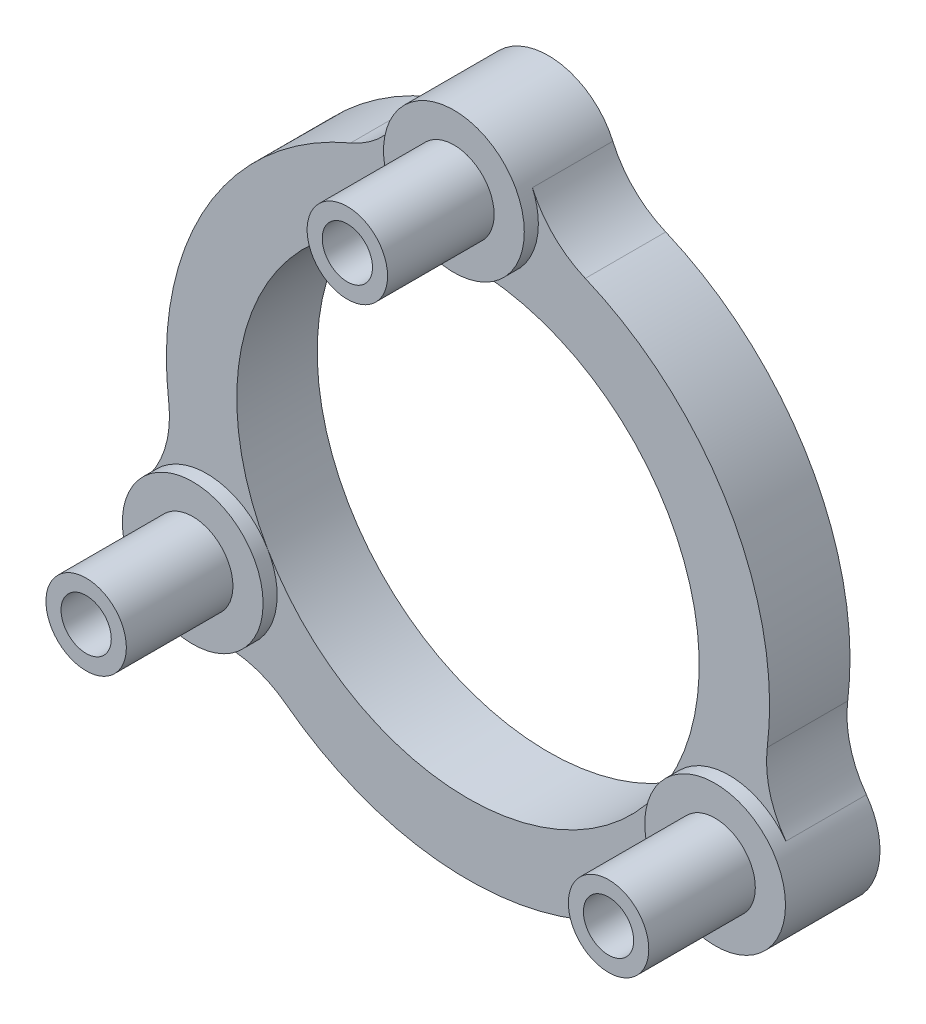
ISO-10303-21;
HEADER;
FILE_DESCRIPTION(('STEP AP214'),'2;1');
FILE_NAME('part.step','',(''),(''),'','','');
FILE_SCHEMA(('AUTOMOTIVE_DESIGN { 1 0 10303 214 1 1 1 1 }'));
ENDSEC;
DATA;
#1=APPLICATION_CONTEXT('core data for automotive mechanical design processes');
#2=APPLICATION_PROTOCOL_DEFINITION('international standard','automotive_design',2000,#1);
#3=PRODUCT_CONTEXT('',#1,'mechanical');
#4=PRODUCT('Part','Part','',(#3));
#5=PRODUCT_RELATED_PRODUCT_CATEGORY('part','',(#4));
#6=PRODUCT_DEFINITION_FORMATION('','',#4);
#7=PRODUCT_DEFINITION_CONTEXT('part definition',#1,'design');
#8=PRODUCT_DEFINITION('design','',#6,#7);
#9=PRODUCT_DEFINITION_SHAPE('','',#8);
#10=(LENGTH_UNIT() NAMED_UNIT(*) SI_UNIT(.MILLI.,.METRE.));
#11=(NAMED_UNIT(*) PLANE_ANGLE_UNIT() SI_UNIT($,.RADIAN.));
#12=(NAMED_UNIT(*) SI_UNIT($,.STERADIAN.) SOLID_ANGLE_UNIT());
#13=UNCERTAINTY_MEASURE_WITH_UNIT(LENGTH_MEASURE(1.E-05),#10,'distance_accuracy_value','');
#14=(GEOMETRIC_REPRESENTATION_CONTEXT(3) GLOBAL_UNCERTAINTY_ASSIGNED_CONTEXT((#13)) GLOBAL_UNIT_ASSIGNED_CONTEXT((#10,
#11,#12)) REPRESENTATION_CONTEXT('',''));
#15=CARTESIAN_POINT('',(0.,0.,0.));
#16=DIRECTION('',(0.,0.,1.));
#17=DIRECTION('',(1.,0.,0.));
#18=AXIS2_PLACEMENT_3D('',#15,#16,#17);
#19=CARTESIAN_POINT('',(0.,0.,4.));
#20=DIRECTION('',(0.,0.,1.));
#21=DIRECTION('',(1.,0.,0.));
#22=AXIS2_PLACEMENT_3D('',#19,#20,#21);
#23=PLANE('',#22);
#24=CARTESIAN_POINT('',(12.0668080819675,-15.9496753168509,4.));
#25=DIRECTION('',(0.,0.,1.));
#26=DIRECTION('',(1.,0.,0.));
#27=AXIS2_PLACEMENT_3D('',#24,#25,#26);
#28=CIRCLE('',#27,5.);
#29=CARTESIAN_POINT('',(9.05010606147561,-11.9622564876382,4.));
#30=VERTEX_POINT('',#29);
#31=CARTESIAN_POINT('',(12.6100863024381,-10.9792780716439,4.));
#32=VERTEX_POINT('',#31);
#33=EDGE_CURVE('E315',#30,#32,#28,.F.);
#34=ORIENTED_EDGE('',*,*,#33,.T.);
#35=CARTESIAN_POINT('',(12.9903810567675,-7.49999999999944,4.));
#36=DIRECTION('',(0.,0.,1.));
#37=DIRECTION('',(1.,0.,0.));
#38=AXIS2_PLACEMENT_3D('',#35,#36,#37);
#39=CIRCLE('',#38,3.49999999999945);
#40=CARTESIAN_POINT('',(9.95929214352141,-5.74999999999936,4.));
#41=VERTEX_POINT('',#40);
#42=EDGE_CURVE('E97',#41,#32,#39,.T.);
#43=ORIENTED_EDGE('',*,*,#42,.F.);
#44=CARTESIAN_POINT('',(0.,0.,4.));
#45=DIRECTION('',(0.,0.,1.));
#46=DIRECTION('',(1.,0.,0.));
#47=AXIS2_PLACEMENT_3D('',#44,#45,#46);
#48=CIRCLE('',#47,11.5);
#49=CARTESIAN_POINT('',(-9.95929214352067,-5.75000000000064,4.));
#50=VERTEX_POINT('',#49);
#51=EDGE_CURVE('E275',#50,#41,#48,.T.);
#52=ORIENTED_EDGE('',*,*,#51,.F.);
#53=CARTESIAN_POINT('',(-12.9903810567656,-7.50000000000056,4.));
#54=DIRECTION('',(0.,0.,1.));
#55=DIRECTION('',(1.,0.,0.));
#56=AXIS2_PLACEMENT_3D('',#53,#54,#55);
#57=CIRCLE('',#56,3.50000000000055);
#58=CARTESIAN_POINT('',(-12.6100863024358,-10.979278071646,4.));
#59=VERTEX_POINT('',#58);
#60=EDGE_CURVE('E225',#59,#50,#57,.T.);
#61=ORIENTED_EDGE('',*,*,#60,.F.);
#62=CARTESIAN_POINT('',(-12.0668080819647,-15.9496753168531,4.));
#63=DIRECTION('',(0.,0.,1.));
#64=DIRECTION('',(1.,0.,0.));
#65=AXIS2_PLACEMENT_3D('',#62,#63,#64);
#66=CIRCLE('',#65,5.);
#67=CARTESIAN_POINT('',(-9.0501060614735,-11.9622564876398,4.));
#68=VERTEX_POINT('',#67);
#69=EDGE_CURVE('E319',#59,#68,#66,.F.);
#70=ORIENTED_EDGE('',*,*,#69,.T.);
#71=CARTESIAN_POINT('',(0.,0.,4.));
#72=DIRECTION('',(0.,0.,1.));
#73=DIRECTION('',(1.,0.,0.));
#74=AXIS2_PLACEMENT_3D('',#71,#72,#73);
#75=CIRCLE('',#74,15.);
#76=EDGE_CURVE('E229',#68,#30,#75,.T.);
#77=ORIENTED_EDGE('',*,*,#76,.T.);
#78=EDGE_LOOP('',(#34,#43,#52,#61,#70,#77));
#79=FACE_BOUND('',#78,.T.);
#80=ADVANCED_FACE('F82',(#79),#23,.T.);
#81=CARTESIAN_POINT('',(0.,11.5,4.));
#82=VERTEX_POINT('',#81);
#83=EDGE_CURVE('E104',#41,#82,#48,.T.);
#84=ORIENTED_EDGE('',*,*,#83,.F.);
#85=CARTESIAN_POINT('',(15.8133768764768,-5.43101604600165,4.));
#86=VERTEX_POINT('',#85);
#87=EDGE_CURVE('E186',#86,#41,#39,.T.);
#88=ORIENTED_EDGE('',*,*,#87,.F.);
#89=CARTESIAN_POINT('',(19.8462280474906,-2.4753246831472,4.));
#90=DIRECTION('',(0.,0.,1.));
#91=DIRECTION('',(1.,0.,0.));
#92=AXIS2_PLACEMENT_3D('',#89,#90,#91);
#93=CIRCLE('',#92,5.);
#94=CARTESIAN_POINT('',(14.8846710356179,-1.8564935123604,4.));
#95=VERTEX_POINT('',#94);
#96=EDGE_CURVE('E195',#86,#95,#93,.F.);
#97=ORIENTED_EDGE('',*,*,#96,.T.);
#98=CARTESIAN_POINT('',(0.,0.,4.));
#99=DIRECTION('',(0.,0.,1.));
#100=DIRECTION('',(1.,0.,0.));
#101=AXIS2_PLACEMENT_3D('',#98,#99,#100);
#102=CIRCLE('',#101,15.);
#103=CARTESIAN_POINT('',(5.83456497414332,13.81875,4.));
#104=VERTEX_POINT('',#103);
#105=EDGE_CURVE('E235',#95,#104,#102,.T.);
#106=ORIENTED_EDGE('',*,*,#105,.T.);
#107=CARTESIAN_POINT('',(7.77941996552442,18.425,4.));
#108=DIRECTION('',(0.,0.,1.));
#109=DIRECTION('',(1.,0.,0.));
#110=AXIS2_PLACEMENT_3D('',#107,#108,#109);
#111=CIRCLE('',#110,5.);
#112=CARTESIAN_POINT('',(3.20329057403947,16.4102941176471,4.));
#113=VERTEX_POINT('',#112);
#114=EDGE_CURVE('E311',#104,#113,#111,.F.);
#115=ORIENTED_EDGE('',*,*,#114,.T.);
#116=CARTESIAN_POINT('',(0.,15.,4.));
#117=DIRECTION('',(0.,0.,1.));
#118=DIRECTION('',(1.,0.,0.));
#119=AXIS2_PLACEMENT_3D('',#116,#117,#118);
#120=CIRCLE('',#119,3.5);
#121=EDGE_CURVE('E215',#82,#113,#120,.T.);
#122=ORIENTED_EDGE('',*,*,#121,.F.);
#123=EDGE_LOOP('',(#84,#88,#97,#106,#115,#122));
#124=FACE_BOUND('',#123,.T.);
#125=ADVANCED_FACE('F204',(#124),#23,.T.);
#126=EDGE_CURVE('E278',#82,#50,#48,.T.);
#127=ORIENTED_EDGE('',*,*,#126,.F.);
#128=CARTESIAN_POINT('',(-3.20329057403947,16.4102941176471,4.));
#129=VERTEX_POINT('',#128);
#130=EDGE_CURVE('E220',#129,#82,#120,.T.);
#131=ORIENTED_EDGE('',*,*,#130,.F.);
#132=CARTESIAN_POINT('',(-7.77941996552442,18.425,4.));
#133=DIRECTION('',(0.,0.,1.));
#134=DIRECTION('',(1.,0.,0.));
#135=AXIS2_PLACEMENT_3D('',#132,#133,#134);
#136=CIRCLE('',#135,5.);
#137=CARTESIAN_POINT('',(-5.83456497414331,13.81875,4.));
#138=VERTEX_POINT('',#137);
#139=EDGE_CURVE('E90',#129,#138,#136,.F.);
#140=ORIENTED_EDGE('',*,*,#139,.T.);
#141=CARTESIAN_POINT('',(0.,0.,4.));
#142=DIRECTION('',(0.,0.,1.));
#143=DIRECTION('',(1.,0.,0.));
#144=AXIS2_PLACEMENT_3D('',#141,#142,#143);
#145=CIRCLE('',#144,15.);
#146=CARTESIAN_POINT('',(-14.8846710356178,-1.85649351236159,4.));
#147=VERTEX_POINT('',#146);
#148=EDGE_CURVE('E238',#138,#147,#145,.T.);
#149=ORIENTED_EDGE('',*,*,#148,.T.);
#150=CARTESIAN_POINT('',(-19.8462280474904,-2.47532468314879,4.));
#151=DIRECTION('',(0.,0.,1.));
#152=DIRECTION('',(1.,0.,0.));
#153=AXIS2_PLACEMENT_3D('',#150,#151,#152);
#154=CIRCLE('',#153,5.);
#155=CARTESIAN_POINT('',(-15.8133768764761,-5.43101604600258,4.));
#156=VERTEX_POINT('',#155);
#157=EDGE_CURVE('E323',#147,#156,#154,.F.);
#158=ORIENTED_EDGE('',*,*,#157,.T.);
#159=EDGE_CURVE('E230',#50,#156,#57,.T.);
#160=ORIENTED_EDGE('',*,*,#159,.F.);
#161=EDGE_LOOP('',(#127,#131,#140,#149,#158,#160));
#162=FACE_BOUND('',#161,.T.);
#163=ADVANCED_FACE('F331',(#162),#23,.T.);
#164=CARTESIAN_POINT('',(0.,0.,0.));
#165=DIRECTION('',(0.,0.,1.));
#166=DIRECTION('',(1.,0.,0.));
#167=AXIS2_PLACEMENT_3D('',#164,#165,#166);
#168=PLANE('',#167);
#169=CARTESIAN_POINT('',(0.,0.,0.));
#170=DIRECTION('',(0.,0.,1.));
#171=DIRECTION('',(1.,0.,0.));
#172=AXIS2_PLACEMENT_3D('',#169,#170,#171);
#173=CIRCLE('',#172,11.5);
#174=CARTESIAN_POINT('',(11.5,0.,0.));
#175=VERTEX_POINT('',#174);
#176=EDGE_CURVE('E274',#175,#175,#173,.T.);
#177=ORIENTED_EDGE('',*,*,#176,.T.);
#178=EDGE_LOOP('',(#177));
#179=FACE_BOUND('',#178,.T.);
#180=CARTESIAN_POINT('',(-12.9903810567656,-7.50000000000056,0.));
#181=DIRECTION('',(0.,0.,1.));
#182=DIRECTION('',(1.,0.,0.));
#183=AXIS2_PLACEMENT_3D('',#180,#181,#182);
#184=CIRCLE('',#183,1.25);
#185=CARTESIAN_POINT('',(-11.7403810567656,-7.50000000000056,0.));
#186=VERTEX_POINT('',#185);
#187=EDGE_CURVE('E262',#186,#186,#184,.T.);
#188=ORIENTED_EDGE('',*,*,#187,.T.);
#189=EDGE_LOOP('',(#188));
#190=FACE_BOUND('',#189,.T.);
#191=CARTESIAN_POINT('',(12.9903810567675,-7.49999999999944,0.));
#192=DIRECTION('',(0.,0.,1.));
#193=DIRECTION('',(1.,0.,0.));
#194=AXIS2_PLACEMENT_3D('',#191,#192,#193);
#195=CIRCLE('',#194,1.25);
#196=CARTESIAN_POINT('',(14.2403810567675,-7.49999999999944,0.));
#197=VERTEX_POINT('',#196);
#198=EDGE_CURVE('E256',#197,#197,#195,.T.);
#199=ORIENTED_EDGE('',*,*,#198,.T.);
#200=EDGE_LOOP('',(#199));
#201=FACE_BOUND('',#200,.T.);
#202=CARTESIAN_POINT('',(0.,15.,0.));
#203=DIRECTION('',(0.,0.,1.));
#204=DIRECTION('',(1.,0.,0.));
#205=AXIS2_PLACEMENT_3D('',#202,#203,#204);
#206=CIRCLE('',#205,1.25);
#207=CARTESIAN_POINT('',(1.25,15.,0.));
#208=VERTEX_POINT('',#207);
#209=EDGE_CURVE('E250',#208,#208,#206,.T.);
#210=ORIENTED_EDGE('',*,*,#209,.T.);
#211=EDGE_LOOP('',(#210));
#212=FACE_BOUND('',#211,.T.);
#213=CARTESIAN_POINT('',(12.9903810567675,-7.49999999999944,0.));
#214=DIRECTION('',(0.,0.,1.));
#215=DIRECTION('',(1.,0.,0.));
#216=AXIS2_PLACEMENT_3D('',#213,#214,#215);
#217=CIRCLE('',#216,3.49999999999945);
#218=CARTESIAN_POINT('',(12.6100863024381,-10.9792780716439,0.));
#219=VERTEX_POINT('',#218);
#220=CARTESIAN_POINT('',(15.8133768764768,-5.43101604600165,0.));
#221=VERTEX_POINT('',#220);
#222=EDGE_CURVE('E188',#219,#221,#217,.T.);
#223=ORIENTED_EDGE('',*,*,#222,.F.);
#224=CARTESIAN_POINT('',(12.0668080819675,-15.9496753168509,0.));
#225=DIRECTION('',(0.,0.,1.));
#226=DIRECTION('',(1.,0.,0.));
#227=AXIS2_PLACEMENT_3D('',#224,#225,#226);
#228=CIRCLE('',#227,5.);
#229=CARTESIAN_POINT('',(9.05010606147561,-11.9622564876382,0.));
#230=VERTEX_POINT('',#229);
#231=EDGE_CURVE('E317',#219,#230,#228,.T.);
#232=ORIENTED_EDGE('',*,*,#231,.T.);
#233=CARTESIAN_POINT('',(0.,0.,0.));
#234=DIRECTION('',(0.,0.,1.));
#235=DIRECTION('',(1.,0.,0.));
#236=AXIS2_PLACEMENT_3D('',#233,#234,#235);
#237=CIRCLE('',#236,15.);
#238=CARTESIAN_POINT('',(-9.0501060614735,-11.9622564876398,0.));
#239=VERTEX_POINT('',#238);
#240=EDGE_CURVE('E286',#239,#230,#237,.T.);
#241=ORIENTED_EDGE('',*,*,#240,.F.);
#242=CARTESIAN_POINT('',(-12.0668080819647,-15.9496753168531,0.));
#243=DIRECTION('',(0.,0.,1.));
#244=DIRECTION('',(1.,0.,0.));
#245=AXIS2_PLACEMENT_3D('',#242,#243,#244);
#246=CIRCLE('',#245,5.);
#247=CARTESIAN_POINT('',(-12.6100863024358,-10.979278071646,0.));
#248=VERTEX_POINT('',#247);
#249=EDGE_CURVE('E321',#239,#248,#246,.T.);
#250=ORIENTED_EDGE('',*,*,#249,.T.);
#251=CARTESIAN_POINT('',(-12.9903810567656,-7.50000000000056,0.));
#252=DIRECTION('',(0.,0.,1.));
#253=DIRECTION('',(1.,0.,0.));
#254=AXIS2_PLACEMENT_3D('',#251,#252,#253);
#255=CIRCLE('',#254,3.50000000000055);
#256=CARTESIAN_POINT('',(-15.8133768764761,-5.43101604600258,0.));
#257=VERTEX_POINT('',#256);
#258=EDGE_CURVE('E244',#257,#248,#255,.T.);
#259=ORIENTED_EDGE('',*,*,#258,.F.);
#260=CARTESIAN_POINT('',(-19.8462280474904,-2.47532468314879,0.));
#261=DIRECTION('',(0.,0.,1.));
#262=DIRECTION('',(1.,0.,0.));
#263=AXIS2_PLACEMENT_3D('',#260,#261,#262);
#264=CIRCLE('',#263,5.);
#265=CARTESIAN_POINT('',(-14.8846710356178,-1.85649351236159,0.));
#266=VERTEX_POINT('',#265);
#267=EDGE_CURVE('E325',#257,#266,#264,.T.);
#268=ORIENTED_EDGE('',*,*,#267,.T.);
#269=CARTESIAN_POINT('',(0.,0.,0.));
#270=DIRECTION('',(0.,0.,1.));
#271=DIRECTION('',(1.,0.,0.));
#272=AXIS2_PLACEMENT_3D('',#269,#270,#271);
#273=CIRCLE('',#272,15.);
#274=CARTESIAN_POINT('',(-5.83456497414331,13.81875,0.));
#275=VERTEX_POINT('',#274);
#276=EDGE_CURVE('E277',#275,#266,#273,.T.);
#277=ORIENTED_EDGE('',*,*,#276,.F.);
#278=CARTESIAN_POINT('',(-7.77941996552442,18.425,0.));
#279=DIRECTION('',(0.,0.,1.));
#280=DIRECTION('',(1.,0.,0.));
#281=AXIS2_PLACEMENT_3D('',#278,#279,#280);
#282=CIRCLE('',#281,5.);
#283=CARTESIAN_POINT('',(-3.20329057403947,16.4102941176471,0.));
#284=VERTEX_POINT('',#283);
#285=EDGE_CURVE('E12',#275,#284,#282,.T.);
#286=ORIENTED_EDGE('',*,*,#285,.T.);
#287=CARTESIAN_POINT('',(0.,15.,0.));
#288=DIRECTION('',(0.,0.,1.));
#289=DIRECTION('',(1.,0.,0.));
#290=AXIS2_PLACEMENT_3D('',#287,#288,#289);
#291=CIRCLE('',#290,3.5);
#292=CARTESIAN_POINT('',(3.20329057403947,16.4102941176471,0.));
#293=VERTEX_POINT('',#292);
#294=EDGE_CURVE('E241',#293,#284,#291,.T.);
#295=ORIENTED_EDGE('',*,*,#294,.F.);
#296=CARTESIAN_POINT('',(7.77941996552442,18.425,0.));
#297=DIRECTION('',(0.,0.,1.));
#298=DIRECTION('',(1.,0.,0.));
#299=AXIS2_PLACEMENT_3D('',#296,#297,#298);
#300=CIRCLE('',#299,5.);
#301=CARTESIAN_POINT('',(5.83456497414332,13.81875,0.));
#302=VERTEX_POINT('',#301);
#303=EDGE_CURVE('E202',#293,#302,#300,.T.);
#304=ORIENTED_EDGE('',*,*,#303,.T.);
#305=CARTESIAN_POINT('',(0.,0.,0.));
#306=DIRECTION('',(0.,0.,1.));
#307=DIRECTION('',(1.,0.,0.));
#308=AXIS2_PLACEMENT_3D('',#305,#306,#307);
#309=CIRCLE('',#308,15.);
#310=CARTESIAN_POINT('',(14.8846710356179,-1.8564935123604,0.));
#311=VERTEX_POINT('',#310);
#312=EDGE_CURVE('E283',#311,#302,#309,.T.);
#313=ORIENTED_EDGE('',*,*,#312,.F.);
#314=CARTESIAN_POINT('',(19.8462280474906,-2.4753246831472,0.));
#315=DIRECTION('',(0.,0.,1.));
#316=DIRECTION('',(1.,0.,0.));
#317=AXIS2_PLACEMENT_3D('',#314,#315,#316);
#318=CIRCLE('',#317,5.);
#319=EDGE_CURVE('E201',#311,#221,#318,.T.);
#320=ORIENTED_EDGE('',*,*,#319,.T.);
#321=EDGE_LOOP('',(#223,#232,#241,#250,#259,#268,#277,#286,#295,#304,#313,#320));
#322=FACE_BOUND('',#321,.T.);
#323=ADVANCED_FACE('F343',(#179,#190,#201,#212,#322),#168,.F.);
#324=CARTESIAN_POINT('',(0.,0.,4.));
#325=DIRECTION('',(0.,0.,-1.));
#326=DIRECTION('',(-1.,0.,0.));
#327=AXIS2_PLACEMENT_3D('',#324,#325,#326);
#328=CYLINDRICAL_SURFACE('',#327,11.5);
#329=ORIENTED_EDGE('',*,*,#51,.T.);
#330=ORIENTED_EDGE('',*,*,#83,.T.);
#331=ORIENTED_EDGE('',*,*,#126,.T.);
#332=EDGE_LOOP('',(#329,#330,#331));
#333=FACE_BOUND('',#332,.T.);
#334=ORIENTED_EDGE('',*,*,#176,.F.);
#335=EDGE_LOOP('',(#334));
#336=FACE_BOUND('',#335,.T.);
#337=ADVANCED_FACE('F356',(#333,#336),#328,.F.);
#338=CARTESIAN_POINT('',(0.,15.,10.));
#339=DIRECTION('',(0.,0.,-1.));
#340=DIRECTION('',(-1.,0.,0.));
#341=AXIS2_PLACEMENT_3D('',#338,#339,#340);
#342=CYLINDRICAL_SURFACE('',#341,2.);
#343=CARTESIAN_POINT('',(0.,15.,4.7));
#344=DIRECTION('',(0.,0.,1.));
#345=DIRECTION('',(1.,0.,0.));
#346=AXIS2_PLACEMENT_3D('',#343,#344,#345);
#347=CIRCLE('',#346,2.);
#348=CARTESIAN_POINT('',(2.,15.,4.7));
#349=VERTEX_POINT('',#348);
#350=EDGE_CURVE('E208',#349,#349,#347,.T.);
#351=ORIENTED_EDGE('',*,*,#350,.T.);
#352=EDGE_LOOP('',(#351));
#353=FACE_BOUND('',#352,.T.);
#354=CARTESIAN_POINT('',(0.,15.,10.));
#355=DIRECTION('',(0.,0.,1.));
#356=DIRECTION('',(1.,0.,0.));
#357=AXIS2_PLACEMENT_3D('',#354,#355,#356);
#358=CIRCLE('',#357,2.);
#359=CARTESIAN_POINT('',(2.,15.,10.));
#360=VERTEX_POINT('',#359);
#361=EDGE_CURVE('E271',#360,#360,#358,.T.);
#362=ORIENTED_EDGE('',*,*,#361,.F.);
#363=EDGE_LOOP('',(#362));
#364=FACE_BOUND('',#363,.T.);
#365=ADVANCED_FACE('F405',(#353,#364),#342,.T.);
#366=CARTESIAN_POINT('',(0.,15.,10.));
#367=DIRECTION('',(0.,0.,1.));
#368=DIRECTION('',(1.,0.,0.));
#369=AXIS2_PLACEMENT_3D('',#366,#367,#368);
#370=PLANE('',#369);
#371=CARTESIAN_POINT('',(0.,15.,10.));
#372=DIRECTION('',(0.,0.,1.));
#373=DIRECTION('',(1.,0.,0.));
#374=AXIS2_PLACEMENT_3D('',#371,#372,#373);
#375=CIRCLE('',#374,1.24999999999999);
#376=CARTESIAN_POINT('',(1.24999999999999,15.,10.));
#377=VERTEX_POINT('',#376);
#378=EDGE_CURVE('E247',#377,#377,#375,.T.);
#379=ORIENTED_EDGE('',*,*,#378,.F.);
#380=EDGE_LOOP('',(#379));
#381=FACE_BOUND('',#380,.T.);
#382=ORIENTED_EDGE('',*,*,#361,.T.);
#383=EDGE_LOOP('',(#382));
#384=FACE_BOUND('',#383,.T.);
#385=ADVANCED_FACE('F463',(#381,#384),#370,.T.);
#386=CARTESIAN_POINT('',(12.9903810567675,-7.49999999999944,10.));
#387=DIRECTION('',(0.,0.,-1.));
#388=DIRECTION('',(-1.,0.,0.));
#389=AXIS2_PLACEMENT_3D('',#386,#387,#388);
#390=CYLINDRICAL_SURFACE('',#389,2.);
#391=CARTESIAN_POINT('',(12.9903810567675,-7.49999999999944,4.7));
#392=DIRECTION('',(0.,0.,1.));
#393=DIRECTION('',(1.,0.,0.));
#394=AXIS2_PLACEMENT_3D('',#391,#392,#393);
#395=CIRCLE('',#394,2.);
#396=CARTESIAN_POINT('',(14.9903810567675,-7.49999999999944,4.7));
#397=VERTEX_POINT('',#396);
#398=EDGE_CURVE('E210',#397,#397,#395,.T.);
#399=ORIENTED_EDGE('',*,*,#398,.T.);
#400=EDGE_LOOP('',(#399));
#401=FACE_BOUND('',#400,.T.);
#402=CARTESIAN_POINT('',(12.9903810567675,-7.49999999999944,10.));
#403=DIRECTION('',(0.,0.,1.));
#404=DIRECTION('',(1.,0.,0.));
#405=AXIS2_PLACEMENT_3D('',#402,#403,#404);
#406=CIRCLE('',#405,2.);
#407=CARTESIAN_POINT('',(14.9903810567675,-7.49999999999944,10.));
#408=VERTEX_POINT('',#407);
#409=EDGE_CURVE('E268',#408,#408,#406,.T.);
#410=ORIENTED_EDGE('',*,*,#409,.F.);
#411=EDGE_LOOP('',(#410));
#412=FACE_BOUND('',#411,.T.);
#413=ADVANCED_FACE('F471',(#401,#412),#390,.T.);
#414=CARTESIAN_POINT('',(12.9903810567675,-7.49999999999944,10.));
#415=DIRECTION('',(0.,0.,1.));
#416=DIRECTION('',(1.,0.,0.));
#417=AXIS2_PLACEMENT_3D('',#414,#415,#416);
#418=PLANE('',#417);
#419=CARTESIAN_POINT('',(12.9903810567675,-7.49999999999944,10.));
#420=DIRECTION('',(0.,0.,1.));
#421=DIRECTION('',(1.,0.,0.));
#422=AXIS2_PLACEMENT_3D('',#419,#420,#421);
#423=CIRCLE('',#422,1.24999999999999);
#424=CARTESIAN_POINT('',(14.2403810567675,-7.49999999999944,10.));
#425=VERTEX_POINT('',#424);
#426=EDGE_CURVE('E253',#425,#425,#423,.T.);
#427=ORIENTED_EDGE('',*,*,#426,.F.);
#428=EDGE_LOOP('',(#427));
#429=FACE_BOUND('',#428,.T.);
#430=ORIENTED_EDGE('',*,*,#409,.T.);
#431=EDGE_LOOP('',(#430));
#432=FACE_BOUND('',#431,.T.);
#433=ADVANCED_FACE('F476',(#429,#432),#418,.T.);
#434=CARTESIAN_POINT('',(-12.9903810567656,-7.50000000000056,10.));
#435=DIRECTION('',(0.,0.,-1.));
#436=DIRECTION('',(-1.,0.,0.));
#437=AXIS2_PLACEMENT_3D('',#434,#435,#436);
#438=CYLINDRICAL_SURFACE('',#437,2.);
#439=CARTESIAN_POINT('',(-12.9903810567656,-7.50000000000056,4.7));
#440=DIRECTION('',(0.,0.,1.));
#441=DIRECTION('',(1.,0.,0.));
#442=AXIS2_PLACEMENT_3D('',#439,#440,#441);
#443=CIRCLE('',#442,2.);
#444=CARTESIAN_POINT('',(-10.9903810567656,-7.50000000000056,4.7));
#445=VERTEX_POINT('',#444);
#446=EDGE_CURVE('E219',#445,#445,#443,.T.);
#447=ORIENTED_EDGE('',*,*,#446,.T.);
#448=EDGE_LOOP('',(#447));
#449=FACE_BOUND('',#448,.T.);
#450=CARTESIAN_POINT('',(-12.9903810567656,-7.50000000000056,10.));
#451=DIRECTION('',(0.,0.,1.));
#452=DIRECTION('',(1.,0.,0.));
#453=AXIS2_PLACEMENT_3D('',#450,#451,#452);
#454=CIRCLE('',#453,2.);
#455=CARTESIAN_POINT('',(-10.9903810567656,-7.50000000000056,10.));
#456=VERTEX_POINT('',#455);
#457=EDGE_CURVE('E265',#456,#456,#454,.T.);
#458=ORIENTED_EDGE('',*,*,#457,.F.);
#459=EDGE_LOOP('',(#458));
#460=FACE_BOUND('',#459,.T.);
#461=ADVANCED_FACE('F484',(#449,#460),#438,.T.);
#462=CARTESIAN_POINT('',(-12.9903810567656,-7.50000000000056,10.));
#463=DIRECTION('',(0.,0.,1.));
#464=DIRECTION('',(1.,0.,0.));
#465=AXIS2_PLACEMENT_3D('',#462,#463,#464);
#466=PLANE('',#465);
#467=CARTESIAN_POINT('',(-12.9903810567656,-7.50000000000056,10.));
#468=DIRECTION('',(0.,0.,1.));
#469=DIRECTION('',(1.,0.,0.));
#470=AXIS2_PLACEMENT_3D('',#467,#468,#469);
#471=CIRCLE('',#470,1.24999999999999);
#472=CARTESIAN_POINT('',(-11.7403810567656,-7.50000000000056,10.));
#473=VERTEX_POINT('',#472);
#474=EDGE_CURVE('E259',#473,#473,#471,.T.);
#475=ORIENTED_EDGE('',*,*,#474,.F.);
#476=EDGE_LOOP('',(#475));
#477=FACE_BOUND('',#476,.T.);
#478=ORIENTED_EDGE('',*,*,#457,.T.);
#479=EDGE_LOOP('',(#478));
#480=FACE_BOUND('',#479,.T.);
#481=ADVANCED_FACE('F489',(#477,#480),#466,.T.);
#482=CARTESIAN_POINT('',(-12.9903810567656,-7.50000000000056,10.));
#483=DIRECTION('',(0.,0.,1.));
#484=DIRECTION('',(1.,0.,0.));
#485=AXIS2_PLACEMENT_3D('',#482,#483,#484);
#486=CYLINDRICAL_SURFACE('',#485,1.24999999999999);
#487=ORIENTED_EDGE('',*,*,#187,.F.);
#488=EDGE_LOOP('',(#487));
#489=FACE_BOUND('',#488,.T.);
#490=ORIENTED_EDGE('',*,*,#474,.T.);
#491=EDGE_LOOP('',(#490));
#492=FACE_BOUND('',#491,.T.);
#493=ADVANCED_FACE('F573',(#489,#492),#486,.F.);
#494=CARTESIAN_POINT('',(12.9903810567675,-7.49999999999944,10.));
#495=DIRECTION('',(0.,0.,1.));
#496=DIRECTION('',(1.,0.,0.));
#497=AXIS2_PLACEMENT_3D('',#494,#495,#496);
#498=CYLINDRICAL_SURFACE('',#497,1.24999999999999);
#499=ORIENTED_EDGE('',*,*,#198,.F.);
#500=EDGE_LOOP('',(#499));
#501=FACE_BOUND('',#500,.T.);
#502=ORIENTED_EDGE('',*,*,#426,.T.);
#503=EDGE_LOOP('',(#502));
#504=FACE_BOUND('',#503,.T.);
#505=ADVANCED_FACE('F563',(#501,#504),#498,.F.);
#506=CARTESIAN_POINT('',(0.,15.,10.));
#507=DIRECTION('',(0.,0.,1.));
#508=DIRECTION('',(1.,0.,0.));
#509=AXIS2_PLACEMENT_3D('',#506,#507,#508);
#510=CYLINDRICAL_SURFACE('',#509,1.24999999999999);
#511=ORIENTED_EDGE('',*,*,#209,.F.);
#512=EDGE_LOOP('',(#511));
#513=FACE_BOUND('',#512,.T.);
#514=ORIENTED_EDGE('',*,*,#378,.T.);
#515=EDGE_LOOP('',(#514));
#516=FACE_BOUND('',#515,.T.);
#517=ADVANCED_FACE('F548',(#513,#516),#510,.F.);
#518=CARTESIAN_POINT('',(0.,0.,-6.));
#519=DIRECTION('',(0.,0.,1.));
#520=DIRECTION('',(1.,0.,0.));
#521=AXIS2_PLACEMENT_3D('',#518,#519,#520);
#522=CYLINDRICAL_SURFACE('',#521,15.);
#523=ORIENTED_EDGE('',*,*,#276,.T.);
#524=DIRECTION('',(0.,0.,1.));
#525=VECTOR('',#524,1.);
#526=CARTESIAN_POINT('',(-14.8846710356178,-1.85649351236159,-6.));
#527=LINE('',#526,#525);
#528=EDGE_CURVE('E308',#266,#147,#527,.T.);
#529=ORIENTED_EDGE('',*,*,#528,.T.);
#530=ORIENTED_EDGE('',*,*,#148,.F.);
#531=DIRECTION('',(0.,0.,1.));
#532=VECTOR('',#531,1.);
#533=CARTESIAN_POINT('',(-5.83456497414331,13.81875,-6.));
#534=LINE('',#533,#532);
#535=EDGE_CURVE('E306',#138,#275,#534,.F.);
#536=ORIENTED_EDGE('',*,*,#535,.T.);
#537=EDGE_LOOP('',(#523,#529,#530,#536));
#538=FACE_BOUND('',#537,.T.);
#539=ADVANCED_FACE('F337',(#538),#522,.T.);
#540=CARTESIAN_POINT('',(-12.9903810567656,-7.50000000000056,-6.));
#541=DIRECTION('',(0.,0.,1.));
#542=DIRECTION('',(1.,0.,0.));
#543=AXIS2_PLACEMENT_3D('',#540,#541,#542);
#544=CYLINDRICAL_SURFACE('',#543,3.50000000000055);
#545=ORIENTED_EDGE('',*,*,#258,.T.);
#546=DIRECTION('',(0.,0.,1.));
#547=VECTOR('',#546,1.);
#548=CARTESIAN_POINT('',(-12.6100863024358,-10.979278071646,-6.));
#549=LINE('',#548,#547);
#550=EDGE_CURVE('E304',#248,#59,#549,.T.);
#551=ORIENTED_EDGE('',*,*,#550,.T.);
#552=ORIENTED_EDGE('',*,*,#60,.T.);
#553=ORIENTED_EDGE('',*,*,#159,.T.);
#554=DIRECTION('',(0.,0.,1.));
#555=VECTOR('',#554,1.);
#556=CARTESIAN_POINT('',(-15.8133768764761,-5.43101604600258,-6.));
#557=LINE('',#556,#555);
#558=EDGE_CURVE('E302',#156,#257,#557,.F.);
#559=ORIENTED_EDGE('',*,*,#558,.T.);
#560=EDGE_LOOP('',(#545,#551,#552,#553,#559));
#561=FACE_BOUND('',#560,.T.);
#562=CARTESIAN_POINT('',(-12.9903810567656,-7.50000000000056,4.7));
#563=DIRECTION('',(0.,0.,1.));
#564=DIRECTION('',(1.,0.,0.));
#565=AXIS2_PLACEMENT_3D('',#562,#563,#564);
#566=CIRCLE('',#565,3.50000000000055);
#567=CARTESIAN_POINT('',(-9.49038105676507,-7.50000000000056,4.7));
#568=VERTEX_POINT('',#567);
#569=EDGE_CURVE('E226',#568,#568,#566,.T.);
#570=ORIENTED_EDGE('',*,*,#569,.F.);
#571=EDGE_LOOP('',(#570));
#572=FACE_BOUND('',#571,.T.);
#573=ADVANCED_FACE('F361',(#561,#572),#544,.T.);
#574=CARTESIAN_POINT('',(0.,15.,-6.));
#575=DIRECTION('',(0.,0.,1.));
#576=DIRECTION('',(1.,0.,0.));
#577=AXIS2_PLACEMENT_3D('',#574,#575,#576);
#578=CYLINDRICAL_SURFACE('',#577,3.5);
#579=DIRECTION('',(0.,0.,1.));
#580=VECTOR('',#579,1.);
#581=CARTESIAN_POINT('',(-3.20329057403947,16.4102941176471,-6.));
#582=LINE('',#581,#580);
#583=EDGE_CURVE('E293',#284,#129,#582,.T.);
#584=ORIENTED_EDGE('',*,*,#583,.T.);
#585=ORIENTED_EDGE('',*,*,#130,.T.);
#586=ORIENTED_EDGE('',*,*,#121,.T.);
#587=DIRECTION('',(0.,0.,1.));
#588=VECTOR('',#587,1.);
#589=CARTESIAN_POINT('',(3.20329057403947,16.4102941176471,-6.));
#590=LINE('',#589,#588);
#591=EDGE_CURVE('E295',#113,#293,#590,.F.);
#592=ORIENTED_EDGE('',*,*,#591,.T.);
#593=ORIENTED_EDGE('',*,*,#294,.T.);
#594=EDGE_LOOP('',(#584,#585,#586,#592,#593));
#595=FACE_BOUND('',#594,.T.);
#596=CARTESIAN_POINT('',(0.,15.,4.7));
#597=DIRECTION('',(0.,0.,1.));
#598=DIRECTION('',(1.,0.,0.));
#599=AXIS2_PLACEMENT_3D('',#596,#597,#598);
#600=CIRCLE('',#599,3.5);
#601=CARTESIAN_POINT('',(3.5,15.,4.7));
#602=VERTEX_POINT('',#601);
#603=EDGE_CURVE('E216',#602,#602,#600,.T.);
#604=ORIENTED_EDGE('',*,*,#603,.F.);
#605=EDGE_LOOP('',(#604));
#606=FACE_BOUND('',#605,.T.);
#607=ADVANCED_FACE('F346',(#595,#606),#578,.T.);
#608=CARTESIAN_POINT('',(0.,0.,-6.));
#609=DIRECTION('',(0.,0.,1.));
#610=DIRECTION('',(1.,0.,0.));
#611=AXIS2_PLACEMENT_3D('',#608,#609,#610);
#612=CYLINDRICAL_SURFACE('',#611,15.);
#613=ORIENTED_EDGE('',*,*,#312,.T.);
#614=DIRECTION('',(0.,0.,1.));
#615=VECTOR('',#614,1.);
#616=CARTESIAN_POINT('',(5.83456497414332,13.81875,-6.));
#617=LINE('',#616,#615);
#618=EDGE_CURVE('E290',#302,#104,#617,.T.);
#619=ORIENTED_EDGE('',*,*,#618,.T.);
#620=ORIENTED_EDGE('',*,*,#105,.F.);
#621=DIRECTION('',(0.,0.,1.));
#622=VECTOR('',#621,1.);
#623=CARTESIAN_POINT('',(14.8846710356179,-1.8564935123604,-6.));
#624=LINE('',#623,#622);
#625=EDGE_CURVE('E197',#95,#311,#624,.F.);
#626=ORIENTED_EDGE('',*,*,#625,.T.);
#627=EDGE_LOOP('',(#613,#619,#620,#626));
#628=FACE_BOUND('',#627,.T.);
#629=ADVANCED_FACE('F354',(#628),#612,.T.);
#630=CARTESIAN_POINT('',(12.9903810567675,-7.49999999999944,-6.));
#631=DIRECTION('',(0.,0.,1.));
#632=DIRECTION('',(1.,0.,0.));
#633=AXIS2_PLACEMENT_3D('',#630,#631,#632);
#634=CYLINDRICAL_SURFACE('',#633,3.49999999999945);
#635=ORIENTED_EDGE('',*,*,#222,.T.);
#636=DIRECTION('',(0.,0.,1.));
#637=VECTOR('',#636,1.);
#638=CARTESIAN_POINT('',(15.8133768764768,-5.43101604600165,-6.));
#639=LINE('',#638,#637);
#640=EDGE_CURVE('E181',#221,#86,#639,.T.);
#641=ORIENTED_EDGE('',*,*,#640,.T.);
#642=ORIENTED_EDGE('',*,*,#87,.T.);
#643=ORIENTED_EDGE('',*,*,#42,.T.);
#644=DIRECTION('',(0.,0.,1.));
#645=VECTOR('',#644,1.);
#646=CARTESIAN_POINT('',(12.6100863024381,-10.9792780716439,-6.));
#647=LINE('',#646,#645);
#648=EDGE_CURVE('E192',#32,#219,#647,.F.);
#649=ORIENTED_EDGE('',*,*,#648,.T.);
#650=EDGE_LOOP('',(#635,#641,#642,#643,#649));
#651=FACE_BOUND('',#650,.T.);
#652=CARTESIAN_POINT('',(12.9903810567675,-7.49999999999944,4.7));
#653=DIRECTION('',(0.,0.,1.));
#654=DIRECTION('',(1.,0.,0.));
#655=AXIS2_PLACEMENT_3D('',#652,#653,#654);
#656=CIRCLE('',#655,3.49999999999945);
#657=CARTESIAN_POINT('',(16.490381056767,-7.49999999999944,4.7));
#658=VERTEX_POINT('',#657);
#659=EDGE_CURVE('E205',#658,#658,#656,.T.);
#660=ORIENTED_EDGE('',*,*,#659,.F.);
#661=EDGE_LOOP('',(#660));
#662=FACE_BOUND('',#661,.T.);
#663=ADVANCED_FACE('F183',(#651,#662),#634,.T.);
#664=CARTESIAN_POINT('',(0.,0.,-6.));
#665=DIRECTION('',(0.,0.,1.));
#666=DIRECTION('',(1.,0.,0.));
#667=AXIS2_PLACEMENT_3D('',#664,#665,#666);
#668=CYLINDRICAL_SURFACE('',#667,15.);
#669=ORIENTED_EDGE('',*,*,#240,.T.);
#670=DIRECTION('',(0.,0.,1.));
#671=VECTOR('',#670,1.);
#672=CARTESIAN_POINT('',(9.05010606147561,-11.9622564876382,-6.));
#673=LINE('',#672,#671);
#674=EDGE_CURVE('E299',#230,#30,#673,.T.);
#675=ORIENTED_EDGE('',*,*,#674,.T.);
#676=ORIENTED_EDGE('',*,*,#76,.F.);
#677=DIRECTION('',(0.,0.,1.));
#678=VECTOR('',#677,1.);
#679=CARTESIAN_POINT('',(-9.0501060614735,-11.9622564876398,-6.));
#680=LINE('',#679,#678);
#681=EDGE_CURVE('E191',#68,#239,#680,.F.);
#682=ORIENTED_EDGE('',*,*,#681,.T.);
#683=EDGE_LOOP('',(#669,#675,#676,#682));
#684=FACE_BOUND('',#683,.T.);
#685=ADVANCED_FACE('F372',(#684),#668,.T.);
#686=CARTESIAN_POINT('',(7.77941996552442,18.425,-6.));
#687=DIRECTION('',(0.,0.,-1.));
#688=DIRECTION('',(-1.,0.,0.));
#689=AXIS2_PLACEMENT_3D('',#686,#687,#688);
#690=CYLINDRICAL_SURFACE('',#689,5.);
#691=ORIENTED_EDGE('',*,*,#303,.F.);
#692=ORIENTED_EDGE('',*,*,#591,.F.);
#693=ORIENTED_EDGE('',*,*,#114,.F.);
#694=ORIENTED_EDGE('',*,*,#618,.F.);
#695=EDGE_LOOP('',(#691,#692,#693,#694));
#696=FACE_BOUND('',#695,.T.);
#697=ADVANCED_FACE('F350',(#696),#690,.F.);
#698=CARTESIAN_POINT('',(19.8462280474906,-2.4753246831472,-6.));
#699=DIRECTION('',(0.,0.,-1.));
#700=DIRECTION('',(-1.,0.,0.));
#701=AXIS2_PLACEMENT_3D('',#698,#699,#700);
#702=CYLINDRICAL_SURFACE('',#701,5.);
#703=ORIENTED_EDGE('',*,*,#319,.F.);
#704=ORIENTED_EDGE('',*,*,#625,.F.);
#705=ORIENTED_EDGE('',*,*,#96,.F.);
#706=ORIENTED_EDGE('',*,*,#640,.F.);
#707=EDGE_LOOP('',(#703,#704,#705,#706));
#708=FACE_BOUND('',#707,.T.);
#709=ADVANCED_FACE('F196',(#708),#702,.F.);
#710=CARTESIAN_POINT('',(12.0668080819675,-15.9496753168509,-6.));
#711=DIRECTION('',(0.,0.,-1.));
#712=DIRECTION('',(-1.,0.,0.));
#713=AXIS2_PLACEMENT_3D('',#710,#711,#712);
#714=CYLINDRICAL_SURFACE('',#713,5.);
#715=ORIENTED_EDGE('',*,*,#231,.F.);
#716=ORIENTED_EDGE('',*,*,#648,.F.);
#717=ORIENTED_EDGE('',*,*,#33,.F.);
#718=ORIENTED_EDGE('',*,*,#674,.F.);
#719=EDGE_LOOP('',(#715,#716,#717,#718));
#720=FACE_BOUND('',#719,.T.);
#721=ADVANCED_FACE('F377',(#720),#714,.F.);
#722=CARTESIAN_POINT('',(-12.0668080819647,-15.9496753168531,-6.));
#723=DIRECTION('',(0.,0.,-1.));
#724=DIRECTION('',(-1.,0.,0.));
#725=AXIS2_PLACEMENT_3D('',#722,#723,#724);
#726=CYLINDRICAL_SURFACE('',#725,5.);
#727=ORIENTED_EDGE('',*,*,#249,.F.);
#728=ORIENTED_EDGE('',*,*,#681,.F.);
#729=ORIENTED_EDGE('',*,*,#69,.F.);
#730=ORIENTED_EDGE('',*,*,#550,.F.);
#731=EDGE_LOOP('',(#727,#728,#729,#730));
#732=FACE_BOUND('',#731,.T.);
#733=ADVANCED_FACE('F369',(#732),#726,.F.);
#734=CARTESIAN_POINT('',(-19.8462280474904,-2.47532468314879,-6.));
#735=DIRECTION('',(0.,0.,-1.));
#736=DIRECTION('',(-1.,0.,0.));
#737=AXIS2_PLACEMENT_3D('',#734,#735,#736);
#738=CYLINDRICAL_SURFACE('',#737,5.);
#739=ORIENTED_EDGE('',*,*,#267,.F.);
#740=ORIENTED_EDGE('',*,*,#558,.F.);
#741=ORIENTED_EDGE('',*,*,#157,.F.);
#742=ORIENTED_EDGE('',*,*,#528,.F.);
#743=EDGE_LOOP('',(#739,#740,#741,#742));
#744=FACE_BOUND('',#743,.T.);
#745=ADVANCED_FACE('F382',(#744),#738,.F.);
#746=CARTESIAN_POINT('',(-7.77941996552442,18.425,-6.));
#747=DIRECTION('',(0.,0.,-1.));
#748=DIRECTION('',(-1.,0.,0.));
#749=AXIS2_PLACEMENT_3D('',#746,#747,#748);
#750=CYLINDRICAL_SURFACE('',#749,5.);
#751=ORIENTED_EDGE('',*,*,#285,.F.);
#752=ORIENTED_EDGE('',*,*,#535,.F.);
#753=ORIENTED_EDGE('',*,*,#139,.F.);
#754=ORIENTED_EDGE('',*,*,#583,.F.);
#755=EDGE_LOOP('',(#751,#752,#753,#754));
#756=FACE_BOUND('',#755,.T.);
#757=ADVANCED_FACE('F84',(#756),#750,.F.);
#758=CARTESIAN_POINT('',(-12.9903810567656,-7.50000000000056,4.7));
#759=DIRECTION('',(0.,0.,1.));
#760=DIRECTION('',(1.,0.,0.));
#761=AXIS2_PLACEMENT_3D('',#758,#759,#760);
#762=PLANE('',#761);
#763=ORIENTED_EDGE('',*,*,#569,.T.);
#764=EDGE_LOOP('',(#763));
#765=FACE_BOUND('',#764,.T.);
#766=ORIENTED_EDGE('',*,*,#446,.F.);
#767=EDGE_LOOP('',(#766));
#768=FACE_BOUND('',#767,.T.);
#769=ADVANCED_FACE('F388',(#765,#768),#762,.T.);
#770=CARTESIAN_POINT('',(0.,15.,4.7));
#771=DIRECTION('',(0.,0.,1.));
#772=DIRECTION('',(1.,0.,0.));
#773=AXIS2_PLACEMENT_3D('',#770,#771,#772);
#774=PLANE('',#773);
#775=ORIENTED_EDGE('',*,*,#603,.T.);
#776=EDGE_LOOP('',(#775));
#777=FACE_BOUND('',#776,.T.);
#778=ORIENTED_EDGE('',*,*,#350,.F.);
#779=EDGE_LOOP('',(#778));
#780=FACE_BOUND('',#779,.T.);
#781=ADVANCED_FACE('F612',(#777,#780),#774,.T.);
#782=CARTESIAN_POINT('',(12.9903810567675,-7.49999999999944,4.7));
#783=DIRECTION('',(0.,0.,1.));
#784=DIRECTION('',(1.,0.,0.));
#785=AXIS2_PLACEMENT_3D('',#782,#783,#784);
#786=PLANE('',#785);
#787=ORIENTED_EDGE('',*,*,#659,.T.);
#788=EDGE_LOOP('',(#787));
#789=FACE_BOUND('',#788,.T.);
#790=ORIENTED_EDGE('',*,*,#398,.F.);
#791=EDGE_LOOP('',(#790));
#792=FACE_BOUND('',#791,.T.);
#793=ADVANCED_FACE('F616',(#789,#792),#786,.T.);
#794=CLOSED_SHELL('',(#80,#125,#163,#323,#337,#365,#385,#413,#433,#461,#481,#493,#505,#517,#539,
#573,#607,#629,#663,#685,#697,#709,#721,#733,#745,#757,#769,#781,#793));
#795=MANIFOLD_SOLID_BREP('B2',#794);
#796=ADVANCED_BREP_SHAPE_REPRESENTATION('',(#18,#795),#14);
#797=SHAPE_DEFINITION_REPRESENTATION(#9,#796);
ENDSEC;
END-ISO-10303-21;
